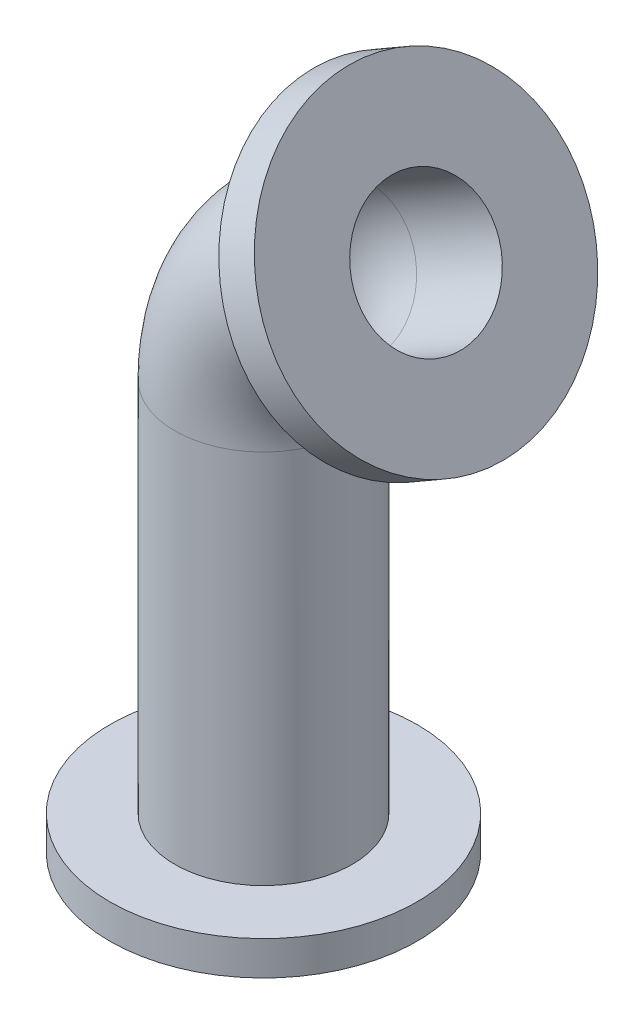
ISO-10303-21;
HEADER;
FILE_DESCRIPTION(('STEP AP214'),'2;1');
FILE_NAME('part.step','',(''),(''),'','','');
FILE_SCHEMA(('AUTOMOTIVE_DESIGN { 1 0 10303 214 1 1 1 1 }'));
ENDSEC;
DATA;
#1=APPLICATION_CONTEXT('core data for automotive mechanical design processes');
#2=APPLICATION_PROTOCOL_DEFINITION('international standard','automotive_design',2000,#1);
#3=PRODUCT_CONTEXT('',#1,'mechanical');
#4=PRODUCT('Part','Part','',(#3));
#5=PRODUCT_RELATED_PRODUCT_CATEGORY('part','',(#4));
#6=PRODUCT_DEFINITION_FORMATION('','',#4);
#7=PRODUCT_DEFINITION_CONTEXT('part definition',#1,'design');
#8=PRODUCT_DEFINITION('design','',#6,#7);
#9=PRODUCT_DEFINITION_SHAPE('','',#8);
#10=(LENGTH_UNIT() NAMED_UNIT(*) SI_UNIT(.MILLI.,.METRE.));
#11=(NAMED_UNIT(*) PLANE_ANGLE_UNIT() SI_UNIT($,.RADIAN.));
#12=(NAMED_UNIT(*) SI_UNIT($,.STERADIAN.) SOLID_ANGLE_UNIT());
#13=UNCERTAINTY_MEASURE_WITH_UNIT(LENGTH_MEASURE(1.E-05),#10,'distance_accuracy_value','');
#14=(GEOMETRIC_REPRESENTATION_CONTEXT(3) GLOBAL_UNCERTAINTY_ASSIGNED_CONTEXT((#13)) GLOBAL_UNIT_ASSIGNED_CONTEXT((#10,
#11,#12)) REPRESENTATION_CONTEXT('',''));
#15=CARTESIAN_POINT('',(0.,0.,0.));
#16=DIRECTION('',(0.,0.,1.));
#17=DIRECTION('',(1.,0.,0.));
#18=AXIS2_PLACEMENT_3D('',#15,#16,#17);
#19=CARTESIAN_POINT('',(22.5000000000001,158.9711431703,0.));
#20=DIRECTION('',(0.866025403784439,0.499999999999999,0.));
#21=DIRECTION('',(-0.499999999999999,0.866025403784439,0.));
#22=AXIS2_PLACEMENT_3D('',#19,#20,#21);
#23=CYLINDRICAL_SURFACE('',#22,26.);
#24=CARTESIAN_POINT('',(22.5000000000001,158.9711431703,0.));
#25=DIRECTION('',(0.86602540378444,0.499999999999998,0.));
#26=DIRECTION('',(0.,0.,1.));
#27=AXIS2_PLACEMENT_3D('',#24,#25,#26);
#28=CIRCLE('',#27,26.);
#29=CARTESIAN_POINT('',(9.50000000000014,181.487803668695,0.));
#30=VERTEX_POINT('',#29);
#31=EDGE_CURVE('E43',#30,#30,#28,.T.);
#32=ORIENTED_EDGE('',*,*,#31,.T.);
#33=EDGE_LOOP('',(#32));
#34=FACE_BOUND('',#33,.T.);
#35=CARTESIAN_POINT('',(37.2224318643355,167.4711431703,0.));
#36=DIRECTION('',(0.86602540378444,0.499999999999998,0.));
#37=DIRECTION('',(-0.499999999999998,0.86602540378444,0.));
#38=AXIS2_PLACEMENT_3D('',#35,#36,#37);
#39=CIRCLE('',#38,26.);
#40=CARTESIAN_POINT('',(24.2224318643356,189.987803668695,0.));
#41=VERTEX_POINT('',#40);
#42=EDGE_CURVE('E71',#41,#41,#39,.T.);
#43=ORIENTED_EDGE('',*,*,#42,.F.);
#44=EDGE_LOOP('',(#43));
#45=FACE_BOUND('',#44,.T.);
#46=ADVANCED_FACE('F33',(#34,#45),#23,.T.);
#47=CARTESIAN_POINT('',(0.,120.,0.));
#48=DIRECTION('',(0.,-1.,0.));
#49=DIRECTION('',(0.,0.,-1.));
#50=AXIS2_PLACEMENT_3D('',#47,#48,#49);
#51=CYLINDRICAL_SURFACE('',#50,26.);
#52=CARTESIAN_POINT('',(0.,120.,0.));
#53=DIRECTION('',(0.,1.,0.));
#54=DIRECTION('',(0.,0.,1.));
#55=AXIS2_PLACEMENT_3D('',#52,#53,#54);
#56=CIRCLE('',#55,26.);
#57=CARTESIAN_POINT('',(-26.,120.,0.));
#58=VERTEX_POINT('',#57);
#59=EDGE_CURVE('E52',#58,#58,#56,.T.);
#60=ORIENTED_EDGE('',*,*,#59,.F.);
#61=EDGE_LOOP('',(#60));
#62=FACE_BOUND('',#61,.T.);
#63=CARTESIAN_POINT('',(0.,9.99999999999999,0.));
#64=DIRECTION('',(0.,-1.,0.));
#65=DIRECTION('',(0.,0.,-1.));
#66=AXIS2_PLACEMENT_3D('',#63,#64,#65);
#67=CIRCLE('',#66,26.);
#68=CARTESIAN_POINT('',(0.,9.99999999999999,-26.));
#69=VERTEX_POINT('',#68);
#70=EDGE_CURVE('E10',#69,#69,#67,.T.);
#71=ORIENTED_EDGE('',*,*,#70,.F.);
#72=EDGE_LOOP('',(#71));
#73=FACE_BOUND('',#72,.T.);
#74=ADVANCED_FACE('F81',(#62,#73),#51,.T.);
#75=CARTESIAN_POINT('',(22.5000000000001,158.9711431703,0.));
#76=DIRECTION('',(0.866025403784439,0.499999999999999,0.));
#77=DIRECTION('',(-0.499999999999999,0.866025403784439,0.));
#78=AXIS2_PLACEMENT_3D('',#75,#76,#77);
#79=CYLINDRICAL_SURFACE('',#78,20.);
#80=CARTESIAN_POINT('',(22.5000000000001,158.9711431703,0.));
#81=DIRECTION('',(0.86602540378444,0.499999999999998,0.));
#82=DIRECTION('',(0.,0.,1.));
#83=AXIS2_PLACEMENT_3D('',#80,#81,#82);
#84=CIRCLE('',#83,20.);
#85=CARTESIAN_POINT('',(12.5000000000001,176.291651245989,0.));
#86=VERTEX_POINT('',#85);
#87=EDGE_CURVE('E47',#86,#86,#84,.T.);
#88=ORIENTED_EDGE('',*,*,#87,.F.);
#89=EDGE_LOOP('',(#88));
#90=FACE_BOUND('',#89,.T.);
#91=CARTESIAN_POINT('',(47.6147367097488,173.4711431703,0.));
#92=DIRECTION('',(0.86602540378444,0.499999999999998,0.));
#93=DIRECTION('',(0.,0.,1.));
#94=AXIS2_PLACEMENT_3D('',#91,#92,#93);
#95=CIRCLE('',#94,20.);
#96=CARTESIAN_POINT('',(47.6147367097488,173.4711431703,20.));
#97=VERTEX_POINT('',#96);
#98=EDGE_CURVE('E39',#97,#97,#95,.T.);
#99=ORIENTED_EDGE('',*,*,#98,.T.);
#100=EDGE_LOOP('',(#99));
#101=FACE_BOUND('',#100,.T.);
#102=ADVANCED_FACE('F86',(#90,#101),#79,.F.);
#103=CARTESIAN_POINT('',(45.,120.,0.));
#104=DIRECTION('',(0.,0.,-1.));
#105=DIRECTION('',(-1.,0.,0.));
#106=AXIS2_PLACEMENT_3D('',#103,#104,#105);
#107=TOROIDAL_SURFACE('',#106,45.,26.);
#108=CARTESIAN_POINT('',(45.,120.,0.));
#109=DIRECTION('',(0.,0.,-1.));
#110=DIRECTION('',(-1.,0.,0.));
#111=AXIS2_PLACEMENT_3D('',#108,#109,#110);
#112=CIRCLE('',#111,71.);
#113=EDGE_CURVE('',#58,#30,#112,.T.);
#114=ORIENTED_EDGE('',*,*,#59,.T.);
#115=ORIENTED_EDGE('',*,*,#31,.F.);
#116=ORIENTED_EDGE('',*,*,#113,.T.);
#117=ORIENTED_EDGE('',*,*,#113,.F.);
#118=EDGE_LOOP('',(#114,#116,#115,#117));
#119=FACE_BOUND('',#118,.T.);
#120=ADVANCED_FACE('F91',(#119),#107,.T.);
#121=CARTESIAN_POINT('',(45.,120.,0.));
#122=DIRECTION('',(0.,0.,-1.));
#123=DIRECTION('',(-1.,0.,0.));
#124=AXIS2_PLACEMENT_3D('',#121,#122,#123);
#125=TOROIDAL_SURFACE('',#124,45.,20.);
#126=CARTESIAN_POINT('',(0.,120.,0.));
#127=DIRECTION('',(0.,1.,0.));
#128=DIRECTION('',(0.,0.,1.));
#129=AXIS2_PLACEMENT_3D('',#126,#127,#128);
#130=CIRCLE('',#129,20.);
#131=CARTESIAN_POINT('',(-20.,120.,0.));
#132=VERTEX_POINT('',#131);
#133=EDGE_CURVE('E56',#132,#132,#130,.T.);
#134=CARTESIAN_POINT('',(45.,120.,0.));
#135=DIRECTION('',(0.,0.,-1.));
#136=DIRECTION('',(-1.,0.,0.));
#137=AXIS2_PLACEMENT_3D('',#134,#135,#136);
#138=CIRCLE('',#137,65.);
#139=EDGE_CURVE('',#132,#86,#138,.T.);
#140=ORIENTED_EDGE('',*,*,#133,.F.);
#141=ORIENTED_EDGE('',*,*,#87,.T.);
#142=ORIENTED_EDGE('',*,*,#139,.T.);
#143=ORIENTED_EDGE('',*,*,#139,.F.);
#144=EDGE_LOOP('',(#140,#142,#141,#143));
#145=FACE_BOUND('',#144,.T.);
#146=ADVANCED_FACE('F93',(#145),#125,.F.);
#147=CARTESIAN_POINT('',(0.,120.,0.));
#148=DIRECTION('',(0.,-1.,0.));
#149=DIRECTION('',(0.,0.,-1.));
#150=AXIS2_PLACEMENT_3D('',#147,#148,#149);
#151=CYLINDRICAL_SURFACE('',#150,20.);
#152=ORIENTED_EDGE('',*,*,#133,.T.);
#153=EDGE_LOOP('',(#152));
#154=FACE_BOUND('',#153,.T.);
#155=CARTESIAN_POINT('',(0.,0.,0.));
#156=DIRECTION('',(0.,1.,0.));
#157=DIRECTION('',(0.,0.,1.));
#158=AXIS2_PLACEMENT_3D('',#155,#156,#157);
#159=CIRCLE('',#158,20.);
#160=CARTESIAN_POINT('',(0.,0.,20.));
#161=VERTEX_POINT('',#160);
#162=EDGE_CURVE('E53',#161,#161,#159,.T.);
#163=ORIENTED_EDGE('',*,*,#162,.F.);
#164=EDGE_LOOP('',(#163));
#165=FACE_BOUND('',#164,.T.);
#166=ADVANCED_FACE('F100',(#154,#165),#151,.F.);
#167=CARTESIAN_POINT('',(47.6147367097488,173.4711431703,0.));
#168=DIRECTION('',(0.86602540378444,0.499999999999998,0.));
#169=DIRECTION('',(0.,0.,1.));
#170=AXIS2_PLACEMENT_3D('',#167,#168,#169);
#171=PLANE('',#170);
#172=ORIENTED_EDGE('',*,*,#98,.F.);
#173=EDGE_LOOP('',(#172));
#174=FACE_BOUND('',#173,.T.);
#175=CARTESIAN_POINT('',(47.6147367097488,173.4711431703,0.));
#176=DIRECTION('',(0.86602540378444,0.499999999999998,0.));
#177=DIRECTION('',(-0.499999999999998,0.86602540378444,0.));
#178=AXIS2_PLACEMENT_3D('',#175,#176,#177);
#179=CIRCLE('',#178,45.);
#180=CARTESIAN_POINT('',(25.1147367097489,212.4422863406,0.));
#181=VERTEX_POINT('',#180);
#182=EDGE_CURVE('E68',#181,#181,#179,.T.);
#183=ORIENTED_EDGE('',*,*,#182,.T.);
#184=EDGE_LOOP('',(#183));
#185=FACE_BOUND('',#184,.T.);
#186=ADVANCED_FACE('F106',(#174,#185),#171,.T.);
#187=CARTESIAN_POINT('',(0.,0.,0.));
#188=DIRECTION('',(0.,1.,0.));
#189=DIRECTION('',(0.,0.,1.));
#190=AXIS2_PLACEMENT_3D('',#187,#188,#189);
#191=PLANE('',#190);
#192=ORIENTED_EDGE('',*,*,#162,.T.);
#193=EDGE_LOOP('',(#192));
#194=FACE_BOUND('',#193,.T.);
#195=CARTESIAN_POINT('',(0.,0.,0.));
#196=DIRECTION('',(0.,-1.,0.));
#197=DIRECTION('',(0.,0.,-1.));
#198=AXIS2_PLACEMENT_3D('',#195,#196,#197);
#199=CIRCLE('',#198,45.);
#200=CARTESIAN_POINT('',(0.,0.,-45.));
#201=VERTEX_POINT('',#200);
#202=EDGE_CURVE('E62',#201,#201,#199,.T.);
#203=ORIENTED_EDGE('',*,*,#202,.T.);
#204=EDGE_LOOP('',(#203));
#205=FACE_BOUND('',#204,.T.);
#206=ADVANCED_FACE('F109',(#194,#205),#191,.F.);
#207=CARTESIAN_POINT('',(0.,10.,0.));
#208=DIRECTION('',(0.,-1.,0.));
#209=DIRECTION('',(0.,0.,-1.));
#210=AXIS2_PLACEMENT_3D('',#207,#208,#209);
#211=CYLINDRICAL_SURFACE('',#210,45.);
#212=CARTESIAN_POINT('',(0.,10.,0.));
#213=DIRECTION('',(0.,-1.,0.));
#214=DIRECTION('',(0.,0.,-1.));
#215=AXIS2_PLACEMENT_3D('',#212,#213,#214);
#216=CIRCLE('',#215,45.);
#217=CARTESIAN_POINT('',(0.,10.,-45.));
#218=VERTEX_POINT('',#217);
#219=EDGE_CURVE('E57',#218,#218,#216,.T.);
#220=ORIENTED_EDGE('',*,*,#219,.T.);
#221=EDGE_LOOP('',(#220));
#222=FACE_BOUND('',#221,.T.);
#223=ORIENTED_EDGE('',*,*,#202,.F.);
#224=EDGE_LOOP('',(#223));
#225=FACE_BOUND('',#224,.T.);
#226=ADVANCED_FACE('F112',(#222,#225),#211,.T.);
#227=CARTESIAN_POINT('',(0.,10.,0.));
#228=DIRECTION('',(0.,-1.,0.));
#229=DIRECTION('',(0.,0.,-1.));
#230=AXIS2_PLACEMENT_3D('',#227,#228,#229);
#231=PLANE('',#230);
#232=ORIENTED_EDGE('',*,*,#70,.T.);
#233=EDGE_LOOP('',(#232));
#234=FACE_BOUND('',#233,.T.);
#235=ORIENTED_EDGE('',*,*,#219,.F.);
#236=EDGE_LOOP('',(#235));
#237=FACE_BOUND('',#236,.T.);
#238=ADVANCED_FACE('F119',(#234,#237),#231,.F.);
#239=CARTESIAN_POINT('',(37.2224318643355,167.4711431703,0.));
#240=DIRECTION('',(0.86602540378444,0.499999999999998,0.));
#241=DIRECTION('',(-0.499999999999998,0.86602540378444,0.));
#242=AXIS2_PLACEMENT_3D('',#239,#240,#241);
#243=CYLINDRICAL_SURFACE('',#242,45.);
#244=CARTESIAN_POINT('',(37.2224318643355,167.4711431703,0.));
#245=DIRECTION('',(0.86602540378444,0.499999999999998,0.));
#246=DIRECTION('',(-0.499999999999998,0.86602540378444,0.));
#247=AXIS2_PLACEMENT_3D('',#244,#245,#246);
#248=CIRCLE('',#247,45.);
#249=CARTESIAN_POINT('',(14.7224318643356,206.4422863406,0.));
#250=VERTEX_POINT('',#249);
#251=EDGE_CURVE('E65',#250,#250,#248,.T.);
#252=ORIENTED_EDGE('',*,*,#251,.T.);
#253=EDGE_LOOP('',(#252));
#254=FACE_BOUND('',#253,.T.);
#255=ORIENTED_EDGE('',*,*,#182,.F.);
#256=EDGE_LOOP('',(#255));
#257=FACE_BOUND('',#256,.T.);
#258=ADVANCED_FACE('F123',(#254,#257),#243,.T.);
#259=CARTESIAN_POINT('',(37.2224318643355,167.4711431703,0.));
#260=DIRECTION('',(0.86602540378444,0.499999999999998,0.));
#261=DIRECTION('',(-0.499999999999998,0.86602540378444,0.));
#262=AXIS2_PLACEMENT_3D('',#259,#260,#261);
#263=PLANE('',#262);
#264=ORIENTED_EDGE('',*,*,#42,.T.);
#265=EDGE_LOOP('',(#264));
#266=FACE_BOUND('',#265,.T.);
#267=ORIENTED_EDGE('',*,*,#251,.F.);
#268=EDGE_LOOP('',(#267));
#269=FACE_BOUND('',#268,.T.);
#270=ADVANCED_FACE('F77',(#266,#269),#263,.F.);
#271=CLOSED_SHELL('',(#46,#74,#102,#120,#146,#166,#186,#206,#226,#238,#258,#270));
#272=MANIFOLD_SOLID_BREP('B2',#271);
#273=ADVANCED_BREP_SHAPE_REPRESENTATION('',(#18,#272),#14);
#274=SHAPE_DEFINITION_REPRESENTATION(#9,#273);
ENDSEC;
END-ISO-10303-21;
